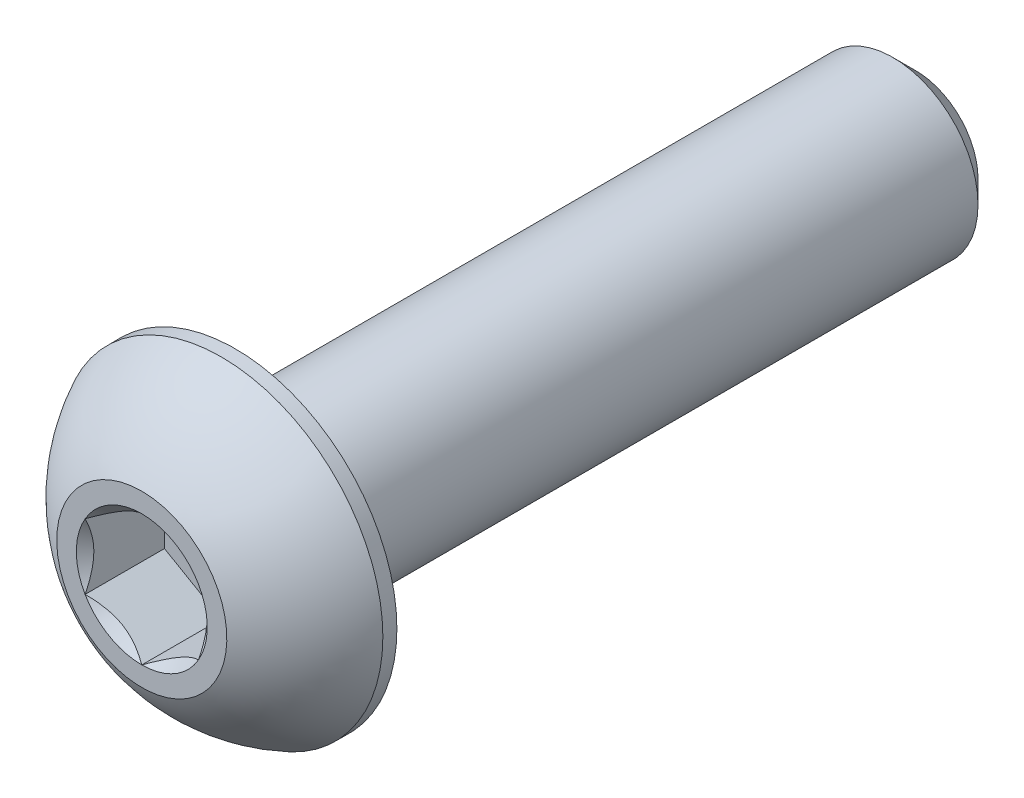
ISO-10303-21;
HEADER;
FILE_DESCRIPTION(('STEP AP214'),'2;1');
FILE_NAME('part.step','',(''),(''),'','','');
FILE_SCHEMA(('AUTOMOTIVE_DESIGN { 1 0 10303 214 1 1 1 1 }'));
ENDSEC;
DATA;
#1=APPLICATION_CONTEXT('core data for automotive mechanical design processes');
#2=APPLICATION_PROTOCOL_DEFINITION('international standard','automotive_design',2000,#1);
#3=PRODUCT_CONTEXT('',#1,'mechanical');
#4=PRODUCT('Part','Part','',(#3));
#5=PRODUCT_RELATED_PRODUCT_CATEGORY('part','',(#4));
#6=PRODUCT_DEFINITION_FORMATION('','',#4);
#7=PRODUCT_DEFINITION_CONTEXT('part definition',#1,'design');
#8=PRODUCT_DEFINITION('design','',#6,#7);
#9=PRODUCT_DEFINITION_SHAPE('','',#8);
#10=(LENGTH_UNIT() NAMED_UNIT(*) SI_UNIT(.MILLI.,.METRE.));
#11=(NAMED_UNIT(*) PLANE_ANGLE_UNIT() SI_UNIT($,.RADIAN.));
#12=(NAMED_UNIT(*) SI_UNIT($,.STERADIAN.) SOLID_ANGLE_UNIT());
#13=UNCERTAINTY_MEASURE_WITH_UNIT(LENGTH_MEASURE(1.E-05),#10,'distance_accuracy_value','');
#14=(GEOMETRIC_REPRESENTATION_CONTEXT(3) GLOBAL_UNCERTAINTY_ASSIGNED_CONTEXT((#13)) GLOBAL_UNIT_ASSIGNED_CONTEXT((#10,
#11,#12)) REPRESENTATION_CONTEXT('',''));
#15=CARTESIAN_POINT('',(0.,0.,0.));
#16=DIRECTION('',(0.,0.,1.));
#17=DIRECTION('',(1.,0.,0.));
#18=AXIS2_PLACEMENT_3D('',#15,#16,#17);
#19=CARTESIAN_POINT('',(0.,0.,6.825));
#20=DIRECTION('',(0.,0.,-1.));
#21=DIRECTION('',(-1.,0.,0.));
#22=AXIS2_PLACEMENT_3D('',#19,#20,#21);
#23=PLANE('',#22);
#24=CARTESIAN_POINT('',(0.,0.,6.825));
#25=DIRECTION('',(0.,0.,1.));
#26=DIRECTION('',(1.,0.,0.));
#27=AXIS2_PLACEMENT_3D('',#24,#25,#26);
#28=CIRCLE('',#27,1.15470053837925);
#29=CARTESIAN_POINT('',(-1.,0.577350269189626,6.825));
#30=VERTEX_POINT('',#29);
#31=CARTESIAN_POINT('',(-1.,-0.577350269189626,6.825));
#32=VERTEX_POINT('',#31);
#33=EDGE_CURVE('E130',#30,#32,#28,.T.);
#34=ORIENTED_EDGE('',*,*,#33,.F.);
#35=CARTESIAN_POINT('',(0.,1.15470053837925,6.825));
#36=VERTEX_POINT('',#35);
#37=EDGE_CURVE('E102',#36,#30,#28,.T.);
#38=ORIENTED_EDGE('',*,*,#37,.F.);
#39=CARTESIAN_POINT('',(1.,0.577350269189626,6.825));
#40=VERTEX_POINT('',#39);
#41=EDGE_CURVE('E93',#40,#36,#28,.T.);
#42=ORIENTED_EDGE('',*,*,#41,.F.);
#43=CARTESIAN_POINT('',(1.,-0.577350269189626,6.825));
#44=VERTEX_POINT('',#43);
#45=EDGE_CURVE('E54',#44,#40,#28,.T.);
#46=ORIENTED_EDGE('',*,*,#45,.F.);
#47=CARTESIAN_POINT('',(0.,-1.15470053837925,6.825));
#48=VERTEX_POINT('',#47);
#49=EDGE_CURVE('E61',#48,#44,#28,.T.);
#50=ORIENTED_EDGE('',*,*,#49,.F.);
#51=EDGE_CURVE('E131',#32,#48,#28,.T.);
#52=ORIENTED_EDGE('',*,*,#51,.F.);
#53=EDGE_LOOP('',(#34,#38,#42,#46,#50,#52));
#54=FACE_BOUND('',#53,.T.);
#55=CARTESIAN_POINT('',(0.,0.,6.825));
#56=DIRECTION('',(0.,0.,1.));
#57=DIRECTION('',(1.,0.,0.));
#58=AXIS2_PLACEMENT_3D('',#55,#56,#57);
#59=CIRCLE('',#58,1.5);
#60=CARTESIAN_POINT('',(0.,1.5,6.825));
#61=VERTEX_POINT('',#60);
#62=EDGE_CURVE('E48',#61,#61,#59,.T.);
#63=ORIENTED_EDGE('',*,*,#62,.T.);
#64=EDGE_LOOP('',(#63));
#65=FACE_BOUND('',#64,.T.);
#66=ADVANCED_FACE('F35',(#54,#65),#23,.F.);
#67=CARTESIAN_POINT('',(0.,0.,4.03016711229946));
#68=DIRECTION('',(0.,0.,1.));
#69=DIRECTION('',(0.,1.,0.));
#70=AXIS2_PLACEMENT_3D('',#67,#68,#69);
#71=SPHERICAL_SURFACE('',#70,3.17192226735973);
#72=CARTESIAN_POINT('',(0.,0.,5.4225));
#73=DIRECTION('',(0.,0.,1.));
#74=DIRECTION('',(1.,0.,0.));
#75=AXIS2_PLACEMENT_3D('',#72,#73,#74);
#76=CIRCLE('',#75,2.85);
#77=CARTESIAN_POINT('',(0.,2.85,5.4225));
#78=VERTEX_POINT('',#77);
#79=EDGE_CURVE('E213',#78,#78,#76,.T.);
#80=CARTESIAN_POINT('',(0.,1.5,6.825));
#81=CARTESIAN_POINT('',(0.,1.5181600798921,6.81525343052664));
#82=CARTESIAN_POINT('',(0.,1.53622513742981,6.80532981527615));
#83=CARTESIAN_POINT('',(0.,1.57215840256594,6.78513236887069));
#84=CARTESIAN_POINT('',(0.,1.59002661016438,6.7748585377157));
#85=CARTESIAN_POINT('',(0.,1.6255593701915,6.75396453515097));
#86=CARTESIAN_POINT('',(0.,1.64322392262019,6.74334436374123));
#87=CARTESIAN_POINT('',(0.,1.67834266450262,6.72176172357303));
#88=CARTESIAN_POINT('',(0.,1.69579685395635,6.71079925481458));
#89=CARTESIAN_POINT('',(0.,1.73048823664554,6.68853618336439));
#90=CARTESIAN_POINT('',(0.,1.74772542988099,6.67723558067265));
#91=CARTESIAN_POINT('',(0.,1.78197627078176,6.65430053581285));
#92=CARTESIAN_POINT('',(0.,1.79898991844709,6.64266609364478));
#93=CARTESIAN_POINT('',(0.,1.83278720341135,6.61906779045309));
#94=CARTESIAN_POINT('',(0.,1.84957084071028,6.60710392942946));
#95=CARTESIAN_POINT('',(0.,1.88290172764636,6.58285133450125));
#96=CARTESIAN_POINT('',(0.,1.8994489772835,6.57056260059666));
#97=CARTESIAN_POINT('',(0.,1.93230080139369,6.54566492927458));
#98=CARTESIAN_POINT('',(0.,1.94860537586673,6.53305599185708));
#99=CARTESIAN_POINT('',(0.,1.98096565436365,6.50752270455889));
#100=CARTESIAN_POINT('',(0.,1.99702135838753,6.49459835467819));
#101=CARTESIAN_POINT('',(0.,2.02887779526296,6.46843915334777));
#102=CARTESIAN_POINT('',(0.,2.04467852811452,6.45520430189805));
#103=CARTESIAN_POINT('',(0.,2.07601901880464,6.42842912630669));
#104=CARTESIAN_POINT('',(0.,2.09155877664321,6.41488880216506));
#105=CARTESIAN_POINT('',(0.,2.12237141262985,6.3875078261379));
#106=CARTESIAN_POINT('',(0.,2.13764429077792,6.37366717425237));
#107=CARTESIAN_POINT('',(0.,2.16791736411296,6.34569080180173));
#108=CARTESIAN_POINT('',(0.,2.18291755929993,6.33155508123663));
#109=CARTESIAN_POINT('',(0.,2.21263956705415,6.30299394260905));
#110=CARTESIAN_POINT('',(0.,2.22736137962139,6.28856852454658));
#111=CARTESIAN_POINT('',(0.,2.2565210282552,6.25943347218353));
#112=CARTESIAN_POINT('',(0.,2.27095886432177,6.24472383788295));
#113=CARTESIAN_POINT('',(0.,2.2995450739765,6.21502594229721));
#114=CARTESIAN_POINT('',(0.,2.31369344756465,6.20003768101205));
#115=CARTESIAN_POINT('',(0.,2.34169535627252,6.16978822658124));
#116=CARTESIAN_POINT('',(0.,2.35554889139223,6.15452703343559));
#117=CARTESIAN_POINT('',(0.,2.38295585920366,6.12373751411442));
#118=CARTESIAN_POINT('',(0.,2.39650929189537,6.1082091879389));
#119=CARTESIAN_POINT('',(0.,2.42331090492182,6.07689130289176));
#120=CARTESIAN_POINT('',(0.,2.43655908525656,6.06110174402014));
#121=CARTESIAN_POINT('',(0.,2.46274515962755,6.02926739317577));
#122=CARTESIAN_POINT('',(0.,2.47568305366379,6.01322260120302));
#123=CARTESIAN_POINT('',(0.,2.50124363939651,5.98088388073287));
#124=CARTESIAN_POINT('',(0.,2.51386633109298,5.96458995223548));
#125=CARTESIAN_POINT('',(0.,2.53879171587278,5.9317591499574));
#126=CARTESIAN_POINT('',(0.,2.55109440895612,5.91522227617671));
#127=CARTESIAN_POINT('',(0.,2.57537512182785,5.88191186688636));
#128=CARTESIAN_POINT('',(0.,2.58735314161625,5.8651383313767));
#129=CARTESIAN_POINT('',(0.,2.61097995657956,5.83136097210575));
#130=CARTESIAN_POINT('',(0.,2.62262875175448,5.81435714834448));
#131=CARTESIAN_POINT('',(0.,2.64559269128198,5.78012567355775));
#132=CARTESIAN_POINT('',(0.,2.65690783563458,5.76289802253229));
#133=CARTESIAN_POINT('',(0.,2.67920017403639,5.72822543922701));
#134=CARTESIAN_POINT('',(0.,2.69017736808561,5.71078050694718));
#135=CARTESIAN_POINT('',(0.,2.711789634999,5.67567998980005));
#136=CARTESIAN_POINT('',(0.,2.72242470786316,5.65802440493275));
#137=CARTESIAN_POINT('',(0.,2.74334869082117,5.62250929096058));
#138=CARTESIAN_POINT('',(0.,2.75363760091502,5.60464976185571));
#139=CARTESIAN_POINT('',(0.,2.77386535089241,5.56873354659176));
#140=CARTESIAN_POINT('',(0.,2.78380419077596,5.55067686043268));
#141=CARTESIAN_POINT('',(0.,2.80332801615778,5.51437318815589));
#142=CARTESIAN_POINT('',(0.,2.81291300165605,5.49612620203818));
#143=CARTESIAN_POINT('',(0.,2.83172550494215,5.45944887791611));
#144=CARTESIAN_POINT('',(0.,2.84095302272998,5.44101853991173));
#145=CARTESIAN_POINT('',(0.,2.85,5.4225));
#146=B_SPLINE_CURVE_WITH_KNOTS('',3,(#80,#81,#82,#83,#84,#85,#86,#87,#88,#89,#90,#91,#92,#93,
#94,#95,#96,#97,#98,#99,#100,#101,#102,#103,#104,#105,#106,#107,#108,#109,#110,#111,#112,#113,
#114,#115,#116,#117,#118,#119,#120,#121,#122,#123,#124,#125,#126,#127,#128,#129,#130,#131,#132,
#133,#134,#135,#136,#137,#138,#139,#140,#141,#142,#143,#144,#145),.UNSPECIFIED.,.F.,.F.,(4,2,2,
2,2,2,2,2,2,2,2,2,2,2,2,2,2,2,2,2,2,2,2,2,2,2,2,2,2,2,2,2,4),(0.,0.0618298941826983,
0.123659788365397,0.185489682548095,0.247319576730793,0.309149470913491,0.370979365096189,
0.432809259278887,0.494639153461586,0.556469047644284,0.618298941826982,0.680128836009681,
0.741958730192379,0.803788624375077,0.865618518557775,0.927448412740473,0.989278306923171,
1.05110820110587,1.11293809528857,1.17476798947127,1.23659788365396,1.29842777783666,
1.36025767201936,1.42208756620206,1.48391746038476,1.54574735456746,1.60757724875015,
1.66940714293285,1.73123703711555,1.79306693129825,1.85489682548095,1.91672671966364,
1.97855661384634),.UNSPECIFIED.);
#147=EDGE_CURVE('BSEAM218',#61,#78,#146,.T.);
#148=ORIENTED_EDGE('',*,*,#62,.F.);
#149=ORIENTED_EDGE('',*,*,#79,.T.);
#150=ORIENTED_EDGE('',*,*,#147,.T.);
#151=ORIENTED_EDGE('',*,*,#147,.F.);
#152=EDGE_LOOP('',(#148,#150,#149,#151));
#153=FACE_BOUND('',#152,.T.);
#154=ADVANCED_FACE('F218',(#153),#71,.T.);
#155=CARTESIAN_POINT('',(0.,0.,6.825));
#156=DIRECTION('',(0.,0.,1.));
#157=DIRECTION('',(1.,0.,0.));
#158=AXIS2_PLACEMENT_3D('',#155,#156,#157);
#159=CYLINDRICAL_SURFACE('',#158,2.85);
#160=ORIENTED_EDGE('',*,*,#79,.F.);
#161=EDGE_LOOP('',(#160));
#162=FACE_BOUND('',#161,.T.);
#163=CARTESIAN_POINT('',(0.,0.,5.175));
#164=DIRECTION('',(0.,0.,1.));
#165=DIRECTION('',(1.,0.,0.));
#166=AXIS2_PLACEMENT_3D('',#163,#164,#165);
#167=CIRCLE('',#166,2.85);
#168=CARTESIAN_POINT('',(2.85,0.,5.175));
#169=VERTEX_POINT('',#168);
#170=EDGE_CURVE('E210',#169,#169,#167,.T.);
#171=ORIENTED_EDGE('',*,*,#170,.T.);
#172=EDGE_LOOP('',(#171));
#173=FACE_BOUND('',#172,.T.);
#174=ADVANCED_FACE('F221',(#162,#173),#159,.T.);
#175=CARTESIAN_POINT('',(0.,1.5,5.175));
#176=DIRECTION('',(0.,0.,1.));
#177=DIRECTION('',(1.,0.,0.));
#178=AXIS2_PLACEMENT_3D('',#175,#176,#177);
#179=PLANE('',#178);
#180=ORIENTED_EDGE('',*,*,#170,.F.);
#181=EDGE_LOOP('',(#180));
#182=FACE_BOUND('',#181,.T.);
#183=CARTESIAN_POINT('',(0.,0.,5.175));
#184=DIRECTION('',(0.,0.,1.));
#185=DIRECTION('',(1.,0.,0.));
#186=AXIS2_PLACEMENT_3D('',#183,#184,#185);
#187=CIRCLE('',#186,1.5);
#188=CARTESIAN_POINT('',(1.5,0.,5.175));
#189=VERTEX_POINT('',#188);
#190=EDGE_CURVE('E207',#189,#189,#187,.T.);
#191=ORIENTED_EDGE('',*,*,#190,.T.);
#192=EDGE_LOOP('',(#191));
#193=FACE_BOUND('',#192,.T.);
#194=ADVANCED_FACE('F226',(#182,#193),#179,.F.);
#195=CARTESIAN_POINT('',(0.,0.,6.825));
#196=DIRECTION('',(0.,0.,1.));
#197=DIRECTION('',(1.,0.,0.));
#198=AXIS2_PLACEMENT_3D('',#195,#196,#197);
#199=CYLINDRICAL_SURFACE('',#198,1.5);
#200=ORIENTED_EDGE('',*,*,#190,.F.);
#201=EDGE_LOOP('',(#200));
#202=FACE_BOUND('',#201,.T.);
#203=CARTESIAN_POINT('',(0.,0.,-6.425));
#204=DIRECTION('',(0.,0.,1.));
#205=DIRECTION('',(1.,0.,0.));
#206=AXIS2_PLACEMENT_3D('',#203,#204,#205);
#207=CIRCLE('',#206,1.5);
#208=CARTESIAN_POINT('',(1.5,0.,-6.425));
#209=VERTEX_POINT('',#208);
#210=EDGE_CURVE('E204',#209,#209,#207,.T.);
#211=ORIENTED_EDGE('',*,*,#210,.T.);
#212=EDGE_LOOP('',(#211));
#213=FACE_BOUND('',#212,.T.);
#214=ADVANCED_FACE('F232',(#202,#213),#199,.T.);
#215=CARTESIAN_POINT('',(0.,0.,-6.825));
#216=DIRECTION('',(0.,0.,1.));
#217=DIRECTION('',(1.,0.,0.));
#218=AXIS2_PLACEMENT_3D('',#215,#216,#217);
#219=CONICAL_SURFACE('',#218,1.1,0.785398163397444);
#220=ORIENTED_EDGE('',*,*,#210,.F.);
#221=EDGE_LOOP('',(#220));
#222=FACE_BOUND('',#221,.T.);
#223=CARTESIAN_POINT('',(0.,0.,-6.825));
#224=DIRECTION('',(0.,0.,1.));
#225=DIRECTION('',(1.,0.,0.));
#226=AXIS2_PLACEMENT_3D('',#223,#224,#225);
#227=CIRCLE('',#226,1.1);
#228=CARTESIAN_POINT('',(1.1,0.,-6.825));
#229=VERTEX_POINT('',#228);
#230=EDGE_CURVE('E191',#229,#229,#227,.T.);
#231=ORIENTED_EDGE('',*,*,#230,.T.);
#232=EDGE_LOOP('',(#231));
#233=FACE_BOUND('',#232,.T.);
#234=ADVANCED_FACE('F238',(#222,#233),#219,.T.);
#235=CARTESIAN_POINT('',(0.,0.,-6.825));
#236=DIRECTION('',(0.,0.,1.));
#237=DIRECTION('',(1.,0.,0.));
#238=AXIS2_PLACEMENT_3D('',#235,#236,#237);
#239=PLANE('',#238);
#240=ORIENTED_EDGE('',*,*,#230,.F.);
#241=EDGE_LOOP('',(#240));
#242=FACE_BOUND('',#241,.T.);
#243=ADVANCED_FACE('F164',(#242),#239,.F.);
#244=CARTESIAN_POINT('',(0.,0.,6.825));
#245=DIRECTION('',(0.,0.,1.));
#246=DIRECTION('',(1.,0.,0.));
#247=AXIS2_PLACEMENT_3D('',#244,#245,#246);
#248=CONICAL_SURFACE('',#247,1.15470053837925,0.78539816339745);
#249=ORIENTED_EDGE('',*,*,#37,.T.);
#250=CARTESIAN_POINT('',(0.000200000000000198,1.15481600843309,6.82511548737261));
#251=CARTESIAN_POINT('',(-0.0341825950071806,1.13496520795026,6.80527793082573));
#252=CARTESIAN_POINT('',(-0.0691401181398248,1.11478247255942,6.78660502063889));
#253=CARTESIAN_POINT('',(-0.14042280295609,1.07362739529219,6.75241474272316));
#254=CARTESIAN_POINT('',(-0.176754750528984,1.0526511355808,6.73691640902346));
#255=CARTESIAN_POINT('',(-0.250016613803311,1.01035337909803,6.71036730714227));
#256=CARTESIAN_POINT('',(-0.286927851445414,0.989042666109241,6.69924977399693));
#257=CARTESIAN_POINT('',(-0.361562729310859,0.945952199282692,6.68211986577618));
#258=CARTESIAN_POINT('',(-0.399284088108636,0.924173762626597,6.67609469746667));
#259=CARTESIAN_POINT('',(-0.464292198417934,0.886641312640015,6.67066055496749));
#260=CARTESIAN_POINT('',(-0.491494371528172,0.870936130672276,6.66985693831673));
#261=CARTESIAN_POINT('',(-0.545846040669112,0.839556179862849,6.67120669941689));
#262=CARTESIAN_POINT('',(-0.572995523754876,0.823881418494924,6.6733607295472));
#263=CARTESIAN_POINT('',(-0.65405627732696,0.777080970599367,6.68411697212847));
#264=CARTESIAN_POINT('',(-0.707564140978428,0.746188191116431,6.69701455641536));
#265=CARTESIAN_POINT('',(-0.801476065143432,0.69196811641965,6.72814073060218));
#266=CARTESIAN_POINT('',(-0.842320523671834,0.668386557293372,6.74473779770184));
#267=CARTESIAN_POINT('',(-0.922409637381943,0.622147085933682,6.78212492468529));
#268=CARTESIAN_POINT('',(-0.961659010870437,0.599486449584576,6.8029013418174));
#269=CARTESIAN_POINT('',(-1.0002,0.577234799135789,6.82511548737261));
#270=B_SPLINE_CURVE_WITH_KNOTS('',3,(#250,#251,#252,#253,#254,#255,#256,#257,#258,#259,#260,
#261,#262,#263,#264,#265,#266,#267,#268,#269),.UNSPECIFIED.,.F.,.F.,(4,2,2,2,2,2,2,2,2,4),(0.,
0.133237676828559,0.267252229834491,0.399137076269301,0.530689603280769,0.624814864263847,
0.718960890149133,0.907306626112098,1.05710100361789,1.20641411519286),.UNSPECIFIED.);
#271=EDGE_CURVE('E11',#36,#30,#270,.T.);
#272=ORIENTED_EDGE('',*,*,#271,.F.);
#273=EDGE_LOOP('',(#249,#272));
#274=FACE_BOUND('',#273,.T.);
#275=ADVANCED_FACE('F106',(#274),#248,.F.);
#276=ORIENTED_EDGE('',*,*,#33,.T.);
#277=CARTESIAN_POINT('',(-1.,-1.15147208646462,7.19538567751386));
#278=CARTESIAN_POINT('',(-1.,-1.12343447988552,7.17421991987371));
#279=CARTESIAN_POINT('',(-1.,-1.09524064850697,7.15326169217591));
#280=CARTESIAN_POINT('',(-1.,-1.03847715644376,7.11184602223562));
#281=CARTESIAN_POINT('',(-1.,-1.00990740382975,7.09138870612366));
#282=CARTESIAN_POINT('',(-1.,-0.923120894333476,7.03060479495451));
#283=CARTESIAN_POINT('',(-1.,-0.864253173759058,6.9911922289614));
#284=CARTESIAN_POINT('',(-1.,-0.740809858258044,6.9138206642002));
#285=CARTESIAN_POINT('',(-1.,-0.676100255137806,6.87607303911434));
#286=CARTESIAN_POINT('',(-1.,-0.543448939049124,6.80702458755129));
#287=CARTESIAN_POINT('',(-1.,-0.475519112027778,6.77570202784686));
#288=CARTESIAN_POINT('',(-1.,-0.373555850333528,6.73738177888379));
#289=CARTESIAN_POINT('',(-1.,-0.341031989670907,6.72638359164216));
#290=CARTESIAN_POINT('',(-1.,-0.275199079052293,6.70699834214736));
#291=CARTESIAN_POINT('',(-1.,-0.241889975173932,6.6986114597767));
#292=CARTESIAN_POINT('',(-1.,-0.175247517042992,6.68502522071902));
#293=CARTESIAN_POINT('',(-1.,-0.141925568218174,6.67977079076797));
#294=CARTESIAN_POINT('',(-1.,-0.0749144362322786,6.67254868657089));
#295=CARTESIAN_POINT('',(-1.,-0.0412251978501614,6.67058151361051));
#296=CARTESIAN_POINT('',(-1.,0.0249580992634213,6.67008319839316));
#297=CARTESIAN_POINT('',(-1.,0.0574512826460395,6.67143026788863));
#298=CARTESIAN_POINT('',(-1.,0.122148505701867,6.67721648449898));
#299=CARTESIAN_POINT('',(-1.,0.154352610132926,6.68165492066153));
#300=CARTESIAN_POINT('',(-1.,0.21879989886764,6.6934568301452));
#301=CARTESIAN_POINT('',(-1.,0.251033743268954,6.70087054103851));
#302=CARTESIAN_POINT('',(-1.,0.314797132354919,6.71822894249867));
#303=CARTESIAN_POINT('',(-1.,0.346326735731005,6.72817342128883));
#304=CARTESIAN_POINT('',(-1.,0.445594187730205,6.76322348255434));
#305=CARTESIAN_POINT('',(-1.,0.511919139476037,6.79232085835672));
#306=CARTESIAN_POINT('',(-1.,0.641453244657533,6.8570153296865));
#307=CARTESIAN_POINT('',(-1.,0.704650133126345,6.89263577671524));
#308=CARTESIAN_POINT('',(-1.,0.825428490174987,6.96612390134693));
#309=CARTESIAN_POINT('',(-1.,0.883132947867684,7.00379194713546));
#310=CARTESIAN_POINT('',(-1.,0.968148853704565,7.06202285294316));
#311=CARTESIAN_POINT('',(-1.,0.996120570380285,7.08163847576285));
#312=CARTESIAN_POINT('',(-1.,1.05168177729901,7.12138851706127));
#313=CARTESIAN_POINT('',(-1.,1.079271369977,7.14152279219883));
#314=CARTESIAN_POINT('',(-1.,1.10670185346329,7.16187211907297));
#315=B_SPLINE_CURVE_WITH_KNOTS('',3,(#277,#278,#279,#280,#281,#282,#283,#284,#285,#286,#287,
#288,#289,#290,#291,#292,#293,#294,#295,#296,#297,#298,#299,#300,#301,#302,#303,#304,#305,#306,
#307,#308,#309,#310,#311,#312,#313,#314),.UNSPECIFIED.,.F.,.F.,(4,2,2,2,2,2,2,2,2,2,2,2,2,2,2,2,
2,2,4),(0.,0.10538645908329,0.210799187330125,0.423233611565469,0.647793540908503,
0.871580877738609,0.97449307418142,1.07741235827201,1.17846428203205,1.27953161415762,
1.3769408673961,1.47432772585408,1.57343322804293,1.67253043972851,1.88917353996827,
2.10660791038813,2.31323734249843,2.41572589232044,2.51818641476503),.UNSPECIFIED.);
#316=EDGE_CURVE('E101',#30,#32,#315,.F.);
#317=ORIENTED_EDGE('',*,*,#316,.F.);
#318=EDGE_LOOP('',(#276,#317));
#319=FACE_BOUND('',#318,.T.);
#320=ADVANCED_FACE('F251',(#319),#248,.F.);
#321=ORIENTED_EDGE('',*,*,#51,.T.);
#322=CARTESIAN_POINT('',(-1.0002,-0.577234799135788,6.82511548737261));
#323=CARTESIAN_POINT('',(-0.965817404992819,-0.597085599618621,6.80527793082573));
#324=CARTESIAN_POINT('',(-0.930859881860175,-0.617268335009456,6.78660502063889));
#325=CARTESIAN_POINT('',(-0.85957719704391,-0.658423412276686,6.75241474272316));
#326=CARTESIAN_POINT('',(-0.823245249471016,-0.67939967198808,6.73691640902346));
#327=CARTESIAN_POINT('',(-0.749983386196689,-0.721697428470846,6.71036730714227));
#328=CARTESIAN_POINT('',(-0.713072148554586,-0.743008141459636,6.69924977399692));
#329=CARTESIAN_POINT('',(-0.638437270689141,-0.786098608286186,6.68211986577618));
#330=CARTESIAN_POINT('',(-0.600715911891364,-0.807877044942281,6.67609469746667));
#331=CARTESIAN_POINT('',(-0.535707801582066,-0.845409494928863,6.67066055496749));
#332=CARTESIAN_POINT('',(-0.508505628471828,-0.861114676896602,6.66985693831673));
#333=CARTESIAN_POINT('',(-0.454153959330888,-0.892494627706029,6.67120669941689));
#334=CARTESIAN_POINT('',(-0.427004476245124,-0.908169389073954,6.6733607295472));
#335=CARTESIAN_POINT('',(-0.34594372267304,-0.954969836969511,6.68411697212847));
#336=CARTESIAN_POINT('',(-0.292435859021573,-0.985862616452447,6.69701455641535));
#337=CARTESIAN_POINT('',(-0.198523934856568,-1.04008269114923,6.72814073060218));
#338=CARTESIAN_POINT('',(-0.157679476328166,-1.06366425027551,6.74473779770184));
#339=CARTESIAN_POINT('',(-0.0775903626180561,-1.1099037216352,6.78212492468529));
#340=CARTESIAN_POINT('',(-0.0383409891295621,-1.1325643579843,6.8029013418174));
#341=CARTESIAN_POINT('',(0.000200000000000036,-1.15481600843309,6.82511548737261));
#342=B_SPLINE_CURVE_WITH_KNOTS('',3,(#322,#323,#324,#325,#326,#327,#328,#329,#330,#331,#332,
#333,#334,#335,#336,#337,#338,#339,#340,#341),.UNSPECIFIED.,.F.,.F.,(4,2,2,2,2,2,2,2,2,4),(0.,
0.133237676828559,0.26725222983449,0.3991370762693,0.530689603280768,0.624814864263846,
0.718960890149133,0.907306626112098,1.05710100361789,1.20641411519286),.UNSPECIFIED.);
#343=EDGE_CURVE('E140',#32,#48,#342,.T.);
#344=ORIENTED_EDGE('',*,*,#343,.F.);
#345=EDGE_LOOP('',(#321,#344));
#346=FACE_BOUND('',#345,.T.);
#347=ADVANCED_FACE('F268',(#346),#248,.F.);
#348=ORIENTED_EDGE('',*,*,#49,.T.);
#349=CARTESIAN_POINT('',(-0.000200000000000295,-1.15481600843309,6.82511548737261));
#350=CARTESIAN_POINT('',(0.0341825950071805,-1.13496520795026,6.80527793082573));
#351=CARTESIAN_POINT('',(0.0691401181398247,-1.11478247255942,6.78660502063889));
#352=CARTESIAN_POINT('',(0.140422802956089,-1.07362739529219,6.75241474272316));
#353=CARTESIAN_POINT('',(0.176754750528984,-1.0526511355808,6.73691640902346));
#354=CARTESIAN_POINT('',(0.250016613803311,-1.01035337909803,6.71036730714226));
#355=CARTESIAN_POINT('',(0.286927851445414,-0.98904266610924,6.69924977399692));
#356=CARTESIAN_POINT('',(0.361562729310859,-0.945952199282691,6.68211986577618));
#357=CARTESIAN_POINT('',(0.399284088108635,-0.924173762626596,6.67609469746667));
#358=CARTESIAN_POINT('',(0.464292198417933,-0.886641312640014,6.67066055496749));
#359=CARTESIAN_POINT('',(0.491494371528171,-0.870936130672275,6.66985693831673));
#360=CARTESIAN_POINT('',(0.545846040669111,-0.839556179862848,6.67120669941689));
#361=CARTESIAN_POINT('',(0.572995523754875,-0.823881418494923,6.6733607295472));
#362=CARTESIAN_POINT('',(0.65405627732696,-0.777080970599367,6.68411697212847));
#363=CARTESIAN_POINT('',(0.707564140978427,-0.74618819111643,6.69701455641535));
#364=CARTESIAN_POINT('',(0.801476065143431,-0.691968116419649,6.72814073060218));
#365=CARTESIAN_POINT('',(0.842320523671834,-0.668386557293371,6.74473779770184));
#366=CARTESIAN_POINT('',(0.922409637381943,-0.622147085933681,6.78212492468529));
#367=CARTESIAN_POINT('',(0.961659010870437,-0.599486449584575,6.8029013418174));
#368=CARTESIAN_POINT('',(1.0002,-0.577234799135788,6.82511548737261));
#369=B_SPLINE_CURVE_WITH_KNOTS('',3,(#349,#350,#351,#352,#353,#354,#355,#356,#357,#358,#359,
#360,#361,#362,#363,#364,#365,#366,#367,#368),.UNSPECIFIED.,.F.,.F.,(4,2,2,2,2,2,2,2,2,4),(0.,
0.133237676828559,0.267252229834491,0.3991370762693,0.530689603280768,0.624814864263846,
0.718960890149133,0.907306626112097,1.05710100361789,1.20641411519286),.UNSPECIFIED.);
#370=EDGE_CURVE('E348',#48,#44,#369,.T.);
#371=ORIENTED_EDGE('',*,*,#370,.F.);
#372=EDGE_LOOP('',(#348,#371));
#373=FACE_BOUND('',#372,.T.);
#374=ADVANCED_FACE('F275',(#373),#248,.F.);
#375=ORIENTED_EDGE('',*,*,#45,.T.);
#376=CARTESIAN_POINT('',(1.,-1.15147208663215,7.19538567764035));
#377=CARTESIAN_POINT('',(1.,-1.12343448004835,7.17421991999533));
#378=CARTESIAN_POINT('',(1.,-1.09524064866509,7.15326169229266));
#379=CARTESIAN_POINT('',(1.,-1.0384771565924,7.11184602234267));
#380=CARTESIAN_POINT('',(1.,-1.00990740397363,7.09138870622588));
#381=CARTESIAN_POINT('',(1.,-0.923120894462775,7.03060479504213));
#382=CARTESIAN_POINT('',(1.,-0.864253173878444,6.99119222903932));
#383=CARTESIAN_POINT('',(1.,-0.74080985835581,6.91382066425819));
#384=CARTESIAN_POINT('',(1.,-0.676100255223808,6.87607303916216));
#385=CARTESIAN_POINT('',(1.,-0.543448939110597,6.80702458758025));
#386=CARTESIAN_POINT('',(1.,-0.475519112076495,6.77570202786713));
#387=CARTESIAN_POINT('',(1.,-0.373555850372647,6.7373817788976));
#388=CARTESIAN_POINT('',(1.,-0.341031989714045,6.72638359165621));
#389=CARTESIAN_POINT('',(1.,-0.275199079103601,6.70699834216111));
#390=CARTESIAN_POINT('',(1.,-0.241889975229392,6.69861145978989));
#391=CARTESIAN_POINT('',(1.,-0.175247517106615,6.68502522073014));
#392=CARTESIAN_POINT('',(1.,-0.141925568285808,6.67977079077761));
#393=CARTESIAN_POINT('',(1.,-0.0749144363078012,6.67254868657667));
#394=CARTESIAN_POINT('',(1.,-0.041225197929563,6.6705815136139));
#395=CARTESIAN_POINT('',(1.,0.024958099176864,6.67008319839111));
#396=CARTESIAN_POINT('',(1.,0.0574512825561955,6.67143026788357));
#397=CARTESIAN_POINT('',(1.,0.122148505605778,6.67721648448742));
#398=CARTESIAN_POINT('',(1.,0.15435261003388,6.68165492064648));
#399=CARTESIAN_POINT('',(1.,0.218799898762754,6.69345683012285));
#400=CARTESIAN_POINT('',(1.,0.251033743161195,6.70087054101231));
#401=CARTESIAN_POINT('',(1.,0.314797132241693,6.71822894246471));
#402=CARTESIAN_POINT('',(1.,0.346326735615183,6.72817342125094));
#403=CARTESIAN_POINT('',(1.,0.445594187589164,6.76322348249794));
#404=CARTESIAN_POINT('',(1.,0.511919139313635,6.7923208582833));
#405=CARTESIAN_POINT('',(1.,0.641453244454049,6.85701532957714));
#406=CARTESIAN_POINT('',(1.,0.70465013290315,6.89263577658696));
#407=CARTESIAN_POINT('',(1.,0.825428489916356,6.96612390118245));
#408=CARTESIAN_POINT('',(1.,0.883132947593201,7.00379194695385));
#409=CARTESIAN_POINT('',(1.,0.968148853406641,7.06202285273595));
#410=CARTESIAN_POINT('',(1.,0.99612057007466,7.08163847554718));
#411=CARTESIAN_POINT('',(1.,1.05168177697804,7.12138851682867));
#412=CARTESIAN_POINT('',(1.,1.07927136964838,7.14152279195778));
#413=CARTESIAN_POINT('',(1.,1.10670185312703,7.16187211882347));
#414=B_SPLINE_CURVE_WITH_KNOTS('',3,(#376,#377,#378,#379,#380,#381,#382,#383,#384,#385,#386,
#387,#388,#389,#390,#391,#392,#393,#394,#395,#396,#397,#398,#399,#400,#401,#402,#403,#404,#405,
#406,#407,#408,#409,#410,#411,#412,#413),.UNSPECIFIED.,.F.,.F.,(4,2,2,2,2,2,2,2,2,2,2,2,2,2,2,2,
2,2,4),(0.,0.10538645910335,0.210799187370248,0.423233611646473,0.647793541035351,
0.871580877910865,0.974493074342054,1.07741235842104,1.17846428216995,1.27953161428439,
1.37694086751269,1.47432772596047,1.57343322813835,1.67253043981296,1.88917353997386,
2.10660791031433,2.31323734235672,2.41572589214523,2.51818641455632),.UNSPECIFIED.);
#415=EDGE_CURVE('E118',#44,#40,#414,.T.);
#416=ORIENTED_EDGE('',*,*,#415,.F.);
#417=EDGE_LOOP('',(#375,#416));
#418=FACE_BOUND('',#417,.T.);
#419=ADVANCED_FACE('F282',(#418),#248,.F.);
#420=ORIENTED_EDGE('',*,*,#41,.T.);
#421=CARTESIAN_POINT('',(1.0002,0.577234799135789,6.82511548737261));
#422=CARTESIAN_POINT('',(0.965817404992819,0.597085599618622,6.80527793082573));
#423=CARTESIAN_POINT('',(0.930859881860175,0.617268335009457,6.78660502063889));
#424=CARTESIAN_POINT('',(0.85957719704391,0.658423412276687,6.75241474272316));
#425=CARTESIAN_POINT('',(0.823245249471016,0.679399671988081,6.73691640902346));
#426=CARTESIAN_POINT('',(0.749983386196689,0.721697428470847,6.71036730714227));
#427=CARTESIAN_POINT('',(0.713072148554585,0.743008141459637,6.69924977399693));
#428=CARTESIAN_POINT('',(0.638437270689141,0.786098608286187,6.68211986577618));
#429=CARTESIAN_POINT('',(0.600715911891364,0.807877044942282,6.67609469746667));
#430=CARTESIAN_POINT('',(0.535707801582066,0.845409494928864,6.67066055496749));
#431=CARTESIAN_POINT('',(0.508505628471828,0.861114676896602,6.66985693831673));
#432=CARTESIAN_POINT('',(0.454153959330888,0.89249462770603,6.67120669941689));
#433=CARTESIAN_POINT('',(0.427004476245124,0.908169389073955,6.6733607295472));
#434=CARTESIAN_POINT('',(0.34594372267304,0.954969836969511,6.68411697212847));
#435=CARTESIAN_POINT('',(0.292435859021572,0.985862616452448,6.69701455641536));
#436=CARTESIAN_POINT('',(0.198523934856568,1.04008269114923,6.72814073060218));
#437=CARTESIAN_POINT('',(0.157679476328166,1.06366425027551,6.74473779770184));
#438=CARTESIAN_POINT('',(0.0775903626180565,1.1099037216352,6.78212492468529));
#439=CARTESIAN_POINT('',(0.0383409891295624,1.1325643579843,6.8029013418174));
#440=CARTESIAN_POINT('',(-0.000199999999999933,1.15481600843309,6.82511548737261));
#441=B_SPLINE_CURVE_WITH_KNOTS('',3,(#421,#422,#423,#424,#425,#426,#427,#428,#429,#430,#431,
#432,#433,#434,#435,#436,#437,#438,#439,#440),.UNSPECIFIED.,.F.,.F.,(4,2,2,2,2,2,2,2,2,4),(0.,
0.133237676828559,0.26725222983449,0.3991370762693,0.530689603280768,0.624814864263846,
0.718960890149133,0.907306626112097,1.05710100361789,1.20641411519286),.UNSPECIFIED.);
#442=EDGE_CURVE('E97',#40,#36,#441,.T.);
#443=ORIENTED_EDGE('',*,*,#442,.F.);
#444=EDGE_LOOP('',(#420,#443));
#445=FACE_BOUND('',#444,.T.);
#446=ADVANCED_FACE('F95',(#445),#248,.F.);
#447=CARTESIAN_POINT('',(0.,0.,5.425));
#448=DIRECTION('',(0.,0.,1.));
#449=DIRECTION('',(1.,0.,0.));
#450=AXIS2_PLACEMENT_3D('',#447,#448,#449);
#451=PLANE('',#450);
#452=DIRECTION('',(-0.866025403784439,0.5,0.));
#453=VECTOR('',#452,1.);
#454=CARTESIAN_POINT('',(1.,0.577350269189626,5.425));
#455=LINE('',#454,#453);
#456=CARTESIAN_POINT('',(1.,0.577350269189626,5.425));
#457=VERTEX_POINT('',#456);
#458=CARTESIAN_POINT('',(0.,1.15470053837925,5.425));
#459=VERTEX_POINT('',#458);
#460=EDGE_CURVE('E117',#457,#459,#455,.T.);
#461=ORIENTED_EDGE('',*,*,#460,.T.);
#462=DIRECTION('',(-0.866025403784439,-0.5,0.));
#463=VECTOR('',#462,1.);
#464=CARTESIAN_POINT('',(0.,1.15470053837925,5.425));
#465=LINE('',#464,#463);
#466=CARTESIAN_POINT('',(-1.,0.577350269189626,5.425));
#467=VERTEX_POINT('',#466);
#468=EDGE_CURVE('E122',#459,#467,#465,.T.);
#469=ORIENTED_EDGE('',*,*,#468,.T.);
#470=DIRECTION('',(0.,-1.,0.));
#471=VECTOR('',#470,1.);
#472=CARTESIAN_POINT('',(-1.,0.577350269189626,5.425));
#473=LINE('',#472,#471);
#474=CARTESIAN_POINT('',(-1.,-0.577350269189625,5.425));
#475=VERTEX_POINT('',#474);
#476=EDGE_CURVE('E179',#467,#475,#473,.T.);
#477=ORIENTED_EDGE('',*,*,#476,.T.);
#478=DIRECTION('',(0.866025403784438,-0.5,0.));
#479=VECTOR('',#478,1.);
#480=CARTESIAN_POINT('',(-1.,-0.577350269189625,5.425));
#481=LINE('',#480,#479);
#482=CARTESIAN_POINT('',(0.,-1.15470053837925,5.425));
#483=VERTEX_POINT('',#482);
#484=EDGE_CURVE('E182',#475,#483,#481,.T.);
#485=ORIENTED_EDGE('',*,*,#484,.T.);
#486=DIRECTION('',(0.866025403784439,0.5,0.));
#487=VECTOR('',#486,1.);
#488=CARTESIAN_POINT('',(0.,-1.15470053837925,5.425));
#489=LINE('',#488,#487);
#490=CARTESIAN_POINT('',(1.,-0.577350269189626,5.425));
#491=VERTEX_POINT('',#490);
#492=EDGE_CURVE('E185',#483,#491,#489,.T.);
#493=ORIENTED_EDGE('',*,*,#492,.T.);
#494=DIRECTION('',(0.,1.,0.));
#495=VECTOR('',#494,1.);
#496=CARTESIAN_POINT('',(1.,-0.577350269189626,5.425));
#497=LINE('',#496,#495);
#498=EDGE_CURVE('E125',#491,#457,#497,.T.);
#499=ORIENTED_EDGE('',*,*,#498,.T.);
#500=EDGE_LOOP('',(#461,#469,#477,#485,#493,#499));
#501=FACE_BOUND('',#500,.T.);
#502=ADVANCED_FACE('F159',(#501),#451,.T.);
#503=CARTESIAN_POINT('',(0.,1.15470053837925,5.425));
#504=DIRECTION('',(-0.5,0.866025403784439,0.));
#505=DIRECTION('',(-0.866025403784439,-0.5,0.));
#506=AXIS2_PLACEMENT_3D('',#503,#504,#505);
#507=PLANE('',#506);
#508=DIRECTION('',(0.,0.,1.));
#509=VECTOR('',#508,1.);
#510=CARTESIAN_POINT('',(0.,1.15470053837925,5.425));
#511=LINE('',#510,#509);
#512=EDGE_CURVE('E114',#459,#36,#511,.T.);
#513=ORIENTED_EDGE('',*,*,#512,.T.);
#514=ORIENTED_EDGE('',*,*,#271,.T.);
#515=DIRECTION('',(0.,0.,1.));
#516=VECTOR('',#515,1.);
#517=CARTESIAN_POINT('',(-1.,0.577350269189626,5.425));
#518=LINE('',#517,#516);
#519=EDGE_CURVE('E124',#467,#30,#518,.T.);
#520=ORIENTED_EDGE('',*,*,#519,.F.);
#521=ORIENTED_EDGE('',*,*,#468,.F.);
#522=EDGE_LOOP('',(#513,#514,#520,#521));
#523=FACE_BOUND('',#522,.T.);
#524=ADVANCED_FACE('F120',(#523),#507,.F.);
#525=CARTESIAN_POINT('',(-1.,0.577350269189626,5.425));
#526=DIRECTION('',(-1.,0.,0.));
#527=DIRECTION('',(0.,0.,1.));
#528=AXIS2_PLACEMENT_3D('',#525,#526,#527);
#529=PLANE('',#528);
#530=ORIENTED_EDGE('',*,*,#519,.T.);
#531=ORIENTED_EDGE('',*,*,#316,.T.);
#532=DIRECTION('',(0.,0.,1.));
#533=VECTOR('',#532,1.);
#534=CARTESIAN_POINT('',(-1.,-0.577350269189625,5.425));
#535=LINE('',#534,#533);
#536=EDGE_CURVE('E198',#475,#32,#535,.T.);
#537=ORIENTED_EDGE('',*,*,#536,.F.);
#538=ORIENTED_EDGE('',*,*,#476,.F.);
#539=EDGE_LOOP('',(#530,#531,#537,#538));
#540=FACE_BOUND('',#539,.T.);
#541=ADVANCED_FACE('F149',(#540),#529,.F.);
#542=CARTESIAN_POINT('',(-1.,-0.577350269189625,5.425));
#543=DIRECTION('',(-0.5,-0.866025403784438,0.));
#544=DIRECTION('',(0.866025403784439,-0.5,0.));
#545=AXIS2_PLACEMENT_3D('',#542,#543,#544);
#546=PLANE('',#545);
#547=ORIENTED_EDGE('',*,*,#536,.T.);
#548=ORIENTED_EDGE('',*,*,#343,.T.);
#549=DIRECTION('',(0.,0.,1.));
#550=VECTOR('',#549,1.);
#551=CARTESIAN_POINT('',(0.,-1.15470053837925,5.425));
#552=LINE('',#551,#550);
#553=EDGE_CURVE('E195',#483,#48,#552,.T.);
#554=ORIENTED_EDGE('',*,*,#553,.F.);
#555=ORIENTED_EDGE('',*,*,#484,.F.);
#556=EDGE_LOOP('',(#547,#548,#554,#555));
#557=FACE_BOUND('',#556,.T.);
#558=ADVANCED_FACE('F152',(#557),#546,.F.);
#559=CARTESIAN_POINT('',(0.,-1.15470053837925,5.425));
#560=DIRECTION('',(0.5,-0.866025403784439,0.));
#561=DIRECTION('',(0.866025403784439,0.5,0.));
#562=AXIS2_PLACEMENT_3D('',#559,#560,#561);
#563=PLANE('',#562);
#564=ORIENTED_EDGE('',*,*,#553,.T.);
#565=ORIENTED_EDGE('',*,*,#370,.T.);
#566=DIRECTION('',(0.,0.,1.));
#567=VECTOR('',#566,1.);
#568=CARTESIAN_POINT('',(1.,-0.577350269189626,5.425));
#569=LINE('',#568,#567);
#570=EDGE_CURVE('E192',#491,#44,#569,.T.);
#571=ORIENTED_EDGE('',*,*,#570,.F.);
#572=ORIENTED_EDGE('',*,*,#492,.F.);
#573=EDGE_LOOP('',(#564,#565,#571,#572));
#574=FACE_BOUND('',#573,.T.);
#575=ADVANCED_FACE('F306',(#574),#563,.F.);
#576=CARTESIAN_POINT('',(1.,-0.577350269189626,5.425));
#577=DIRECTION('',(1.,0.,0.));
#578=DIRECTION('',(0.,1.,0.));
#579=AXIS2_PLACEMENT_3D('',#576,#577,#578);
#580=PLANE('',#579);
#581=ORIENTED_EDGE('',*,*,#570,.T.);
#582=ORIENTED_EDGE('',*,*,#415,.T.);
#583=DIRECTION('',(0.,0.,1.));
#584=VECTOR('',#583,1.);
#585=CARTESIAN_POINT('',(1.,0.577350269189626,5.425));
#586=LINE('',#585,#584);
#587=EDGE_CURVE('E116',#457,#40,#586,.T.);
#588=ORIENTED_EDGE('',*,*,#587,.F.);
#589=ORIENTED_EDGE('',*,*,#498,.F.);
#590=EDGE_LOOP('',(#581,#582,#588,#589));
#591=FACE_BOUND('',#590,.T.);
#592=ADVANCED_FACE('F163',(#591),#580,.F.);
#593=CARTESIAN_POINT('',(1.,0.577350269189626,5.425));
#594=DIRECTION('',(0.5,0.866025403784439,0.));
#595=DIRECTION('',(-0.866025403784439,0.5,0.));
#596=AXIS2_PLACEMENT_3D('',#593,#594,#595);
#597=PLANE('',#596);
#598=ORIENTED_EDGE('',*,*,#587,.T.);
#599=ORIENTED_EDGE('',*,*,#442,.T.);
#600=ORIENTED_EDGE('',*,*,#512,.F.);
#601=ORIENTED_EDGE('',*,*,#460,.F.);
#602=EDGE_LOOP('',(#598,#599,#600,#601));
#603=FACE_BOUND('',#602,.T.);
#604=ADVANCED_FACE('F112',(#603),#597,.F.);
#605=CLOSED_SHELL('',(#66,#154,#174,#194,#214,#234,#243,#275,#320,#347,#374,#419,#446,#502,#524,
#541,#558,#575,#592,#604));
#606=MANIFOLD_SOLID_BREP('B2',#605);
#607=ADVANCED_BREP_SHAPE_REPRESENTATION('',(#18,#606),#14);
#608=SHAPE_DEFINITION_REPRESENTATION(#9,#607);
ENDSEC;
END-ISO-10303-21;
